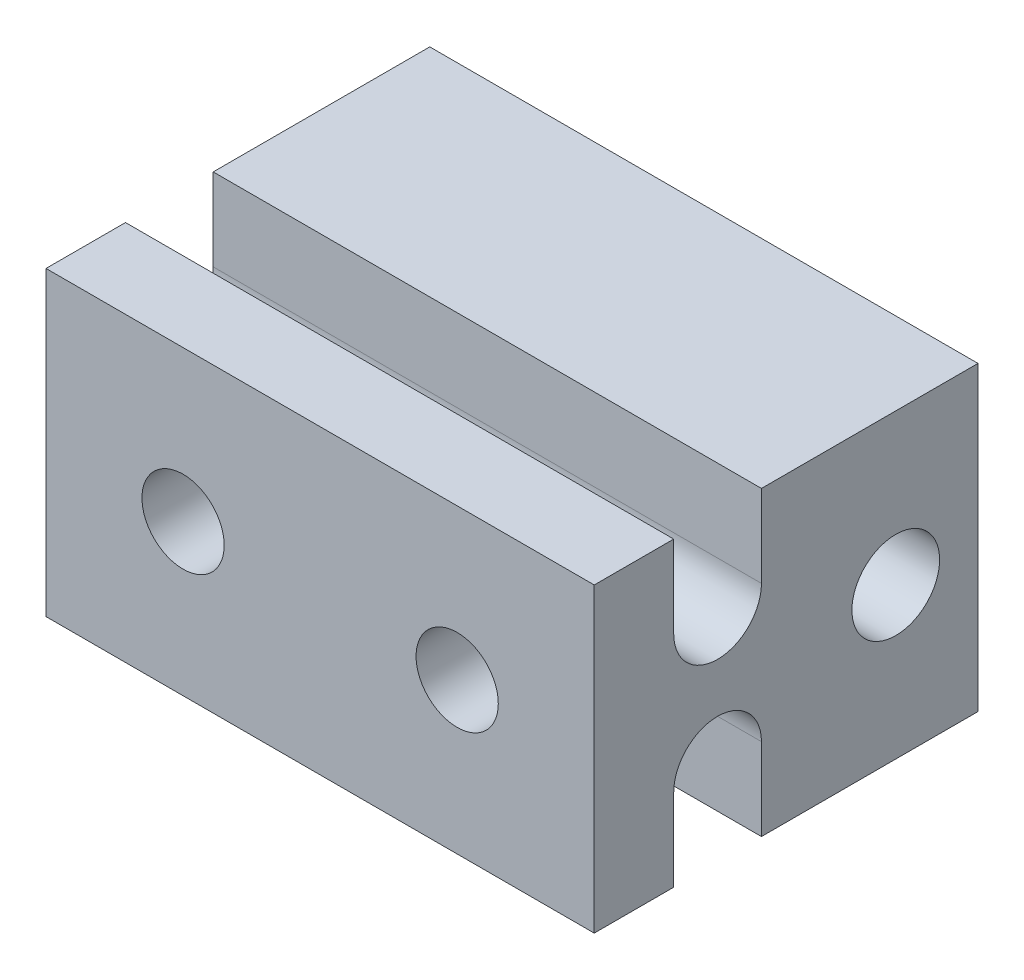
ISO-10303-21;
HEADER;
FILE_DESCRIPTION(('STEP AP214'),'2;1');
FILE_NAME('part.step','',(''),(''),'','','');
FILE_SCHEMA(('AUTOMOTIVE_DESIGN { 1 0 10303 214 1 1 1 1 }'));
ENDSEC;
DATA;
#1=APPLICATION_CONTEXT('core data for automotive mechanical design processes');
#2=APPLICATION_PROTOCOL_DEFINITION('international standard','automotive_design',2000,#1);
#3=PRODUCT_CONTEXT('',#1,'mechanical');
#4=PRODUCT('Part','Part','',(#3));
#5=PRODUCT_RELATED_PRODUCT_CATEGORY('part','',(#4));
#6=PRODUCT_DEFINITION_FORMATION('','',#4);
#7=PRODUCT_DEFINITION_CONTEXT('part definition',#1,'design');
#8=PRODUCT_DEFINITION('design','',#6,#7);
#9=PRODUCT_DEFINITION_SHAPE('','',#8);
#10=(LENGTH_UNIT() NAMED_UNIT(*) SI_UNIT(.MILLI.,.METRE.));
#11=(NAMED_UNIT(*) PLANE_ANGLE_UNIT() SI_UNIT($,.RADIAN.));
#12=(NAMED_UNIT(*) SI_UNIT($,.STERADIAN.) SOLID_ANGLE_UNIT());
#13=UNCERTAINTY_MEASURE_WITH_UNIT(LENGTH_MEASURE(1.E-05),#10,'distance_accuracy_value','');
#14=(GEOMETRIC_REPRESENTATION_CONTEXT(3) GLOBAL_UNCERTAINTY_ASSIGNED_CONTEXT((#13)) GLOBAL_UNIT_ASSIGNED_CONTEXT((#10,
#11,#12)) REPRESENTATION_CONTEXT('',''));
#15=CARTESIAN_POINT('',(0.,0.,0.));
#16=DIRECTION('',(0.,0.,1.));
#17=DIRECTION('',(1.,0.,0.));
#18=AXIS2_PLACEMENT_3D('',#15,#16,#17);
#19=CARTESIAN_POINT('',(10.,5.5,-14.));
#20=DIRECTION('',(1.,0.,0.));
#21=DIRECTION('',(0.,1.,0.));
#22=AXIS2_PLACEMENT_3D('',#19,#20,#21);
#23=PLANE('',#22);
#24=CARTESIAN_POINT('',(10.,0.,-11.));
#25=DIRECTION('',(1.,0.,0.));
#26=DIRECTION('',(0.,1.,0.));
#27=AXIS2_PLACEMENT_3D('',#24,#25,#26);
#28=CIRCLE('',#27,1.6);
#29=CARTESIAN_POINT('',(10.,1.6,-11.));
#30=VERTEX_POINT('',#29);
#31=EDGE_CURVE('E174',#30,#30,#28,.T.);
#32=ORIENTED_EDGE('',*,*,#31,.F.);
#33=EDGE_LOOP('',(#32));
#34=FACE_BOUND('',#33,.T.);
#35=CARTESIAN_POINT('',(10.,2.5,-4.5));
#36=DIRECTION('',(1.,0.,0.));
#37=DIRECTION('',(0.,1.,0.));
#38=AXIS2_PLACEMENT_3D('',#35,#36,#37);
#39=CIRCLE('',#38,1.6);
#40=CARTESIAN_POINT('',(10.,2.5,-2.9));
#41=VERTEX_POINT('',#40);
#42=CARTESIAN_POINT('',(10.,2.5,-6.1));
#43=VERTEX_POINT('',#42);
#44=EDGE_CURVE('E156',#41,#43,#39,.T.);
#45=ORIENTED_EDGE('',*,*,#44,.F.);
#46=DIRECTION('',(0.,1.,0.));
#47=VECTOR('',#46,1.);
#48=CARTESIAN_POINT('',(10.,0.,-2.9));
#49=LINE('',#48,#47);
#50=CARTESIAN_POINT('',(10.,5.5,-2.9));
#51=VERTEX_POINT('',#50);
#52=EDGE_CURVE('E137',#41,#51,#49,.T.);
#53=ORIENTED_EDGE('',*,*,#52,.T.);
#54=DIRECTION('',(0.,0.,1.));
#55=VECTOR('',#54,1.);
#56=CARTESIAN_POINT('',(10.,5.5,-14.));
#57=LINE('',#56,#55);
#58=CARTESIAN_POINT('',(10.,5.5,0.));
#59=VERTEX_POINT('',#58);
#60=EDGE_CURVE('E214',#51,#59,#57,.T.);
#61=ORIENTED_EDGE('',*,*,#60,.T.);
#62=DIRECTION('',(0.,1.,0.));
#63=VECTOR('',#62,1.);
#64=CARTESIAN_POINT('',(10.,5.5,0.));
#65=LINE('',#64,#63);
#66=CARTESIAN_POINT('',(10.,-5.5,0.));
#67=VERTEX_POINT('',#66);
#68=EDGE_CURVE('E194',#67,#59,#65,.T.);
#69=ORIENTED_EDGE('',*,*,#68,.F.);
#70=DIRECTION('',(0.,0.,1.));
#71=VECTOR('',#70,1.);
#72=CARTESIAN_POINT('',(10.,-5.5,-14.));
#73=LINE('',#72,#71);
#74=CARTESIAN_POINT('',(10.,-5.5,-2.9));
#75=VERTEX_POINT('',#74);
#76=EDGE_CURVE('E49',#75,#67,#73,.T.);
#77=ORIENTED_EDGE('',*,*,#76,.F.);
#78=DIRECTION('',(0.,-1.,0.));
#79=VECTOR('',#78,1.);
#80=CARTESIAN_POINT('',(10.,0.,-2.9));
#81=LINE('',#80,#79);
#82=CARTESIAN_POINT('',(10.,-2.5,-2.9));
#83=VERTEX_POINT('',#82);
#84=EDGE_CURVE('E181',#83,#75,#81,.T.);
#85=ORIENTED_EDGE('',*,*,#84,.F.);
#86=CARTESIAN_POINT('',(10.,-2.5,-4.5));
#87=DIRECTION('',(1.,0.,0.));
#88=DIRECTION('',(0.,1.,0.));
#89=AXIS2_PLACEMENT_3D('',#86,#87,#88);
#90=CIRCLE('',#89,1.6);
#91=CARTESIAN_POINT('',(10.,-2.5,-6.1));
#92=VERTEX_POINT('',#91);
#93=EDGE_CURVE('E188',#92,#83,#90,.T.);
#94=ORIENTED_EDGE('',*,*,#93,.F.);
#95=DIRECTION('',(0.,-1.,0.));
#96=VECTOR('',#95,1.);
#97=CARTESIAN_POINT('',(10.,0.,-6.1));
#98=LINE('',#97,#96);
#99=CARTESIAN_POINT('',(10.,-5.5,-6.1));
#100=VERTEX_POINT('',#99);
#101=EDGE_CURVE('E168',#92,#100,#98,.T.);
#102=ORIENTED_EDGE('',*,*,#101,.T.);
#103=CARTESIAN_POINT('',(10.,-5.5,-14.));
#104=VERTEX_POINT('',#103);
#105=EDGE_CURVE('E11',#104,#100,#73,.T.);
#106=ORIENTED_EDGE('',*,*,#105,.F.);
#107=DIRECTION('',(0.,1.,0.));
#108=VECTOR('',#107,1.);
#109=CARTESIAN_POINT('',(10.,5.5,-14.));
#110=LINE('',#109,#108);
#111=CARTESIAN_POINT('',(10.,5.5,-14.));
#112=VERTEX_POINT('',#111);
#113=EDGE_CURVE('E201',#104,#112,#110,.T.);
#114=ORIENTED_EDGE('',*,*,#113,.T.);
#115=CARTESIAN_POINT('',(10.,5.5,-6.1));
#116=VERTEX_POINT('',#115);
#117=EDGE_CURVE('E44',#112,#116,#57,.T.);
#118=ORIENTED_EDGE('',*,*,#117,.T.);
#119=DIRECTION('',(0.,1.,0.));
#120=VECTOR('',#119,1.);
#121=CARTESIAN_POINT('',(10.,0.,-6.1));
#122=LINE('',#121,#120);
#123=EDGE_CURVE('E65',#43,#116,#122,.T.);
#124=ORIENTED_EDGE('',*,*,#123,.F.);
#125=EDGE_LOOP('',(#45,#53,#61,#69,#77,#85,#94,#102,#106,#114,#118,#124));
#126=FACE_BOUND('',#125,.T.);
#127=ADVANCED_FACE('F41',(#34,#126),#23,.T.);
#128=CARTESIAN_POINT('',(-10.,-5.5,-14.));
#129=DIRECTION('',(0.,-1.,0.));
#130=DIRECTION('',(0.,0.,-1.));
#131=AXIS2_PLACEMENT_3D('',#128,#129,#130);
#132=PLANE('',#131);
#133=ORIENTED_EDGE('',*,*,#105,.T.);
#134=DIRECTION('',(1.,0.,0.));
#135=VECTOR('',#134,1.);
#136=CARTESIAN_POINT('',(-10.,-5.50000000000001,-6.1));
#137=LINE('',#136,#135);
#138=CARTESIAN_POINT('',(-10.,-5.50000000000001,-6.1));
#139=VERTEX_POINT('',#138);
#140=EDGE_CURVE('E192',#139,#100,#137,.T.);
#141=ORIENTED_EDGE('',*,*,#140,.F.);
#142=DIRECTION('',(0.,0.,1.));
#143=VECTOR('',#142,1.);
#144=CARTESIAN_POINT('',(-10.,-5.5,-14.));
#145=LINE('',#144,#143);
#146=CARTESIAN_POINT('',(-10.,-5.5,-14.));
#147=VERTEX_POINT('',#146);
#148=EDGE_CURVE('E225',#147,#139,#145,.T.);
#149=ORIENTED_EDGE('',*,*,#148,.F.);
#150=DIRECTION('',(1.,0.,0.));
#151=VECTOR('',#150,1.);
#152=CARTESIAN_POINT('',(-10.,-5.5,-14.));
#153=LINE('',#152,#151);
#154=EDGE_CURVE('E211',#147,#104,#153,.T.);
#155=ORIENTED_EDGE('',*,*,#154,.T.);
#156=EDGE_LOOP('',(#133,#141,#149,#155));
#157=FACE_BOUND('',#156,.T.);
#158=ADVANCED_FACE('F258',(#157),#132,.T.);
#159=CARTESIAN_POINT('',(-10.,5.5,-14.));
#160=DIRECTION('',(-1.,0.,0.));
#161=DIRECTION('',(0.,-1.,0.));
#162=AXIS2_PLACEMENT_3D('',#159,#160,#161);
#163=PLANE('',#162);
#164=CARTESIAN_POINT('',(-10.,0.,-11.));
#165=DIRECTION('',(1.,0.,0.));
#166=DIRECTION('',(0.,1.,0.));
#167=AXIS2_PLACEMENT_3D('',#164,#165,#166);
#168=CIRCLE('',#167,1.6);
#169=CARTESIAN_POINT('',(-10.,1.6,-11.));
#170=VERTEX_POINT('',#169);
#171=EDGE_CURVE('E164',#170,#170,#168,.T.);
#172=ORIENTED_EDGE('',*,*,#171,.T.);
#173=EDGE_LOOP('',(#172));
#174=FACE_BOUND('',#173,.T.);
#175=DIRECTION('',(0.,0.,1.));
#176=VECTOR('',#175,1.);
#177=CARTESIAN_POINT('',(-10.,5.5,-14.));
#178=LINE('',#177,#176);
#179=CARTESIAN_POINT('',(-10.,5.49999999999999,-2.9));
#180=VERTEX_POINT('',#179);
#181=CARTESIAN_POINT('',(-10.,5.5,0.));
#182=VERTEX_POINT('',#181);
#183=EDGE_CURVE('E154',#180,#182,#178,.T.);
#184=ORIENTED_EDGE('',*,*,#183,.F.);
#185=DIRECTION('',(0.,1.,0.));
#186=VECTOR('',#185,1.);
#187=CARTESIAN_POINT('',(-10.,0.,-2.9));
#188=LINE('',#187,#186);
#189=CARTESIAN_POINT('',(-10.,2.5,-2.9));
#190=VERTEX_POINT('',#189);
#191=EDGE_CURVE('E134',#190,#180,#188,.T.);
#192=ORIENTED_EDGE('',*,*,#191,.F.);
#193=CARTESIAN_POINT('',(-10.,2.5,-4.5));
#194=DIRECTION('',(1.,0.,0.));
#195=DIRECTION('',(0.,1.,0.));
#196=AXIS2_PLACEMENT_3D('',#193,#194,#195);
#197=CIRCLE('',#196,1.6);
#198=CARTESIAN_POINT('',(-10.,2.5,-6.1));
#199=VERTEX_POINT('',#198);
#200=EDGE_CURVE('E145',#190,#199,#197,.T.);
#201=ORIENTED_EDGE('',*,*,#200,.T.);
#202=DIRECTION('',(0.,1.,0.));
#203=VECTOR('',#202,1.);
#204=CARTESIAN_POINT('',(-10.,0.,-6.1));
#205=LINE('',#204,#203);
#206=CARTESIAN_POINT('',(-10.,5.49999999999999,-6.1));
#207=VERTEX_POINT('',#206);
#208=EDGE_CURVE('E142',#199,#207,#205,.T.);
#209=ORIENTED_EDGE('',*,*,#208,.T.);
#210=CARTESIAN_POINT('',(-10.,5.5,-14.));
#211=VERTEX_POINT('',#210);
#212=EDGE_CURVE('E228',#211,#207,#178,.T.);
#213=ORIENTED_EDGE('',*,*,#212,.F.);
#214=DIRECTION('',(0.,-1.,0.));
#215=VECTOR('',#214,1.);
#216=CARTESIAN_POINT('',(-10.,5.5,-14.));
#217=LINE('',#216,#215);
#218=EDGE_CURVE('E208',#211,#147,#217,.T.);
#219=ORIENTED_EDGE('',*,*,#218,.T.);
#220=ORIENTED_EDGE('',*,*,#148,.T.);
#221=DIRECTION('',(0.,-1.,0.));
#222=VECTOR('',#221,1.);
#223=CARTESIAN_POINT('',(-10.,0.,-6.1));
#224=LINE('',#223,#222);
#225=CARTESIAN_POINT('',(-10.,-2.5,-6.1));
#226=VERTEX_POINT('',#225);
#227=EDGE_CURVE('E178',#226,#139,#224,.T.);
#228=ORIENTED_EDGE('',*,*,#227,.F.);
#229=CARTESIAN_POINT('',(-10.,-2.5,-4.5));
#230=DIRECTION('',(1.,0.,0.));
#231=DIRECTION('',(0.,1.,0.));
#232=AXIS2_PLACEMENT_3D('',#229,#230,#231);
#233=CIRCLE('',#232,1.6);
#234=CARTESIAN_POINT('',(-10.,-2.5,-2.9));
#235=VERTEX_POINT('',#234);
#236=EDGE_CURVE('E180',#226,#235,#233,.T.);
#237=ORIENTED_EDGE('',*,*,#236,.T.);
#238=DIRECTION('',(0.,-1.,0.));
#239=VECTOR('',#238,1.);
#240=CARTESIAN_POINT('',(-10.,0.,-2.9));
#241=LINE('',#240,#239);
#242=CARTESIAN_POINT('',(-10.,-5.50000000000001,-2.9));
#243=VERTEX_POINT('',#242);
#244=EDGE_CURVE('E57',#235,#243,#241,.T.);
#245=ORIENTED_EDGE('',*,*,#244,.T.);
#246=CARTESIAN_POINT('',(-10.,-5.5,0.));
#247=VERTEX_POINT('',#246);
#248=EDGE_CURVE('E227',#243,#247,#145,.T.);
#249=ORIENTED_EDGE('',*,*,#248,.T.);
#250=DIRECTION('',(0.,-1.,0.));
#251=VECTOR('',#250,1.);
#252=CARTESIAN_POINT('',(-10.,5.5,0.));
#253=LINE('',#252,#251);
#254=EDGE_CURVE('E220',#182,#247,#253,.T.);
#255=ORIENTED_EDGE('',*,*,#254,.F.);
#256=EDGE_LOOP('',(#184,#192,#201,#209,#213,#219,#220,#228,#237,#245,#249,#255));
#257=FACE_BOUND('',#256,.T.);
#258=ADVANCED_FACE('F152',(#174,#257),#163,.T.);
#259=CARTESIAN_POINT('',(-10.,5.5,-14.));
#260=DIRECTION('',(0.,1.,0.));
#261=DIRECTION('',(-1.,0.,0.));
#262=AXIS2_PLACEMENT_3D('',#259,#260,#261);
#263=PLANE('',#262);
#264=ORIENTED_EDGE('',*,*,#60,.F.);
#265=DIRECTION('',(1.,0.,0.));
#266=VECTOR('',#265,1.);
#267=CARTESIAN_POINT('',(-10.,5.49999999999999,-2.9));
#268=LINE('',#267,#266);
#269=EDGE_CURVE('E166',#180,#51,#268,.T.);
#270=ORIENTED_EDGE('',*,*,#269,.F.);
#271=ORIENTED_EDGE('',*,*,#183,.T.);
#272=DIRECTION('',(-1.,0.,0.));
#273=VECTOR('',#272,1.);
#274=CARTESIAN_POINT('',(-10.,5.5,0.));
#275=LINE('',#274,#273);
#276=EDGE_CURVE('E217',#59,#182,#275,.T.);
#277=ORIENTED_EDGE('',*,*,#276,.F.);
#278=EDGE_LOOP('',(#264,#270,#271,#277));
#279=FACE_BOUND('',#278,.T.);
#280=ADVANCED_FACE('F238',(#279),#263,.T.);
#281=DIRECTION('',(1.,0.,0.));
#282=VECTOR('',#281,1.);
#283=CARTESIAN_POINT('',(-10.,-5.50000000000001,-2.9));
#284=LINE('',#283,#282);
#285=EDGE_CURVE('E195',#243,#75,#284,.T.);
#286=ORIENTED_EDGE('',*,*,#285,.T.);
#287=ORIENTED_EDGE('',*,*,#76,.T.);
#288=DIRECTION('',(1.,0.,0.));
#289=VECTOR('',#288,1.);
#290=CARTESIAN_POINT('',(-10.,-5.5,0.));
#291=LINE('',#290,#289);
#292=EDGE_CURVE('E205',#247,#67,#291,.T.);
#293=ORIENTED_EDGE('',*,*,#292,.F.);
#294=ORIENTED_EDGE('',*,*,#248,.F.);
#295=EDGE_LOOP('',(#286,#287,#293,#294));
#296=FACE_BOUND('',#295,.T.);
#297=ADVANCED_FACE('F244',(#296),#132,.T.);
#298=DIRECTION('',(1.,0.,0.));
#299=VECTOR('',#298,1.);
#300=CARTESIAN_POINT('',(-10.,5.49999999999999,-6.1));
#301=LINE('',#300,#299);
#302=EDGE_CURVE('E169',#207,#116,#301,.T.);
#303=ORIENTED_EDGE('',*,*,#302,.T.);
#304=ORIENTED_EDGE('',*,*,#117,.F.);
#305=DIRECTION('',(-1.,0.,0.));
#306=VECTOR('',#305,1.);
#307=CARTESIAN_POINT('',(-10.,5.5,-14.));
#308=LINE('',#307,#306);
#309=EDGE_CURVE('E204',#112,#211,#308,.T.);
#310=ORIENTED_EDGE('',*,*,#309,.T.);
#311=ORIENTED_EDGE('',*,*,#212,.T.);
#312=EDGE_LOOP('',(#303,#304,#310,#311));
#313=FACE_BOUND('',#312,.T.);
#314=ADVANCED_FACE('F264',(#313),#263,.T.);
#315=CARTESIAN_POINT('',(0.,0.,-14.));
#316=DIRECTION('',(0.,0.,1.));
#317=DIRECTION('',(1.,0.,0.));
#318=AXIS2_PLACEMENT_3D('',#315,#316,#317);
#319=PLANE('',#318);
#320=ORIENTED_EDGE('',*,*,#113,.F.);
#321=ORIENTED_EDGE('',*,*,#154,.F.);
#322=ORIENTED_EDGE('',*,*,#218,.F.);
#323=ORIENTED_EDGE('',*,*,#309,.F.);
#324=EDGE_LOOP('',(#320,#321,#322,#323));
#325=FACE_BOUND('',#324,.T.);
#326=ADVANCED_FACE('F262',(#325),#319,.F.);
#327=CARTESIAN_POINT('',(0.,0.,0.));
#328=DIRECTION('',(0.,0.,1.));
#329=DIRECTION('',(1.,0.,0.));
#330=AXIS2_PLACEMENT_3D('',#327,#328,#329);
#331=PLANE('',#330);
#332=CARTESIAN_POINT('',(-5.,0.,0.));
#333=DIRECTION('',(0.,0.,1.));
#334=DIRECTION('',(1.,0.,0.));
#335=AXIS2_PLACEMENT_3D('',#332,#333,#334);
#336=CIRCLE('',#335,1.5);
#337=CARTESIAN_POINT('',(-3.5,0.,0.));
#338=VERTEX_POINT('',#337);
#339=EDGE_CURVE('E474',#338,#338,#336,.T.);
#340=ORIENTED_EDGE('',*,*,#339,.F.);
#341=EDGE_LOOP('',(#340));
#342=FACE_BOUND('',#341,.T.);
#343=CARTESIAN_POINT('',(5.,0.,0.));
#344=DIRECTION('',(0.,0.,1.));
#345=DIRECTION('',(1.,0.,0.));
#346=AXIS2_PLACEMENT_3D('',#343,#344,#345);
#347=CIRCLE('',#346,1.5);
#348=CARTESIAN_POINT('',(6.5,0.,0.));
#349=VERTEX_POINT('',#348);
#350=EDGE_CURVE('E159',#349,#349,#347,.T.);
#351=ORIENTED_EDGE('',*,*,#350,.F.);
#352=EDGE_LOOP('',(#351));
#353=FACE_BOUND('',#352,.T.);
#354=ORIENTED_EDGE('',*,*,#68,.T.);
#355=ORIENTED_EDGE('',*,*,#276,.T.);
#356=ORIENTED_EDGE('',*,*,#254,.T.);
#357=ORIENTED_EDGE('',*,*,#292,.T.);
#358=EDGE_LOOP('',(#354,#355,#356,#357));
#359=FACE_BOUND('',#358,.T.);
#360=ADVANCED_FACE('F240',(#342,#353,#359),#331,.T.);
#361=CARTESIAN_POINT('',(-10.,0.,-2.9));
#362=DIRECTION('',(0.,0.,-1.));
#363=DIRECTION('',(0.,1.,0.));
#364=AXIS2_PLACEMENT_3D('',#361,#362,#363);
#365=PLANE('',#364);
#366=ORIENTED_EDGE('',*,*,#52,.F.);
#367=DIRECTION('',(1.,0.,0.));
#368=VECTOR('',#367,1.);
#369=CARTESIAN_POINT('',(-10.,2.5,-2.9));
#370=LINE('',#369,#368);
#371=EDGE_CURVE('E130',#190,#41,#370,.T.);
#372=ORIENTED_EDGE('',*,*,#371,.F.);
#373=ORIENTED_EDGE('',*,*,#191,.T.);
#374=ORIENTED_EDGE('',*,*,#269,.T.);
#375=EDGE_LOOP('',(#366,#372,#373,#374));
#376=FACE_BOUND('',#375,.T.);
#377=ADVANCED_FACE('F132',(#376),#365,.T.);
#378=CARTESIAN_POINT('',(-10.,0.,-6.1));
#379=DIRECTION('',(0.,0.,-1.));
#380=DIRECTION('',(-1.,0.,0.));
#381=AXIS2_PLACEMENT_3D('',#378,#379,#380);
#382=PLANE('',#381);
#383=ORIENTED_EDGE('',*,*,#123,.T.);
#384=ORIENTED_EDGE('',*,*,#302,.F.);
#385=ORIENTED_EDGE('',*,*,#208,.F.);
#386=DIRECTION('',(1.,0.,0.));
#387=VECTOR('',#386,1.);
#388=CARTESIAN_POINT('',(-10.,2.5,-6.1));
#389=LINE('',#388,#387);
#390=EDGE_CURVE('E141',#199,#43,#389,.T.);
#391=ORIENTED_EDGE('',*,*,#390,.T.);
#392=EDGE_LOOP('',(#383,#384,#385,#391));
#393=FACE_BOUND('',#392,.T.);
#394=ADVANCED_FACE('F265',(#393),#382,.F.);
#395=CARTESIAN_POINT('',(-10.,2.5,-4.5));
#396=DIRECTION('',(1.,0.,0.));
#397=DIRECTION('',(0.,1.,0.));
#398=AXIS2_PLACEMENT_3D('',#395,#396,#397);
#399=CYLINDRICAL_SURFACE('',#398,1.6);
#400=ORIENTED_EDGE('',*,*,#44,.T.);
#401=ORIENTED_EDGE('',*,*,#390,.F.);
#402=ORIENTED_EDGE('',*,*,#200,.F.);
#403=ORIENTED_EDGE('',*,*,#371,.T.);
#404=EDGE_LOOP('',(#400,#401,#402,#403));
#405=FACE_BOUND('',#404,.T.);
#406=ADVANCED_FACE('F146',(#405),#399,.F.);
#407=CARTESIAN_POINT('',(-10.,0.,-6.1));
#408=DIRECTION('',(0.,0.,1.));
#409=DIRECTION('',(0.,-1.,0.));
#410=AXIS2_PLACEMENT_3D('',#407,#408,#409);
#411=PLANE('',#410);
#412=ORIENTED_EDGE('',*,*,#101,.F.);
#413=DIRECTION('',(1.,0.,0.));
#414=VECTOR('',#413,1.);
#415=CARTESIAN_POINT('',(-10.,-2.5,-6.1));
#416=LINE('',#415,#414);
#417=EDGE_CURVE('E185',#226,#92,#416,.T.);
#418=ORIENTED_EDGE('',*,*,#417,.F.);
#419=ORIENTED_EDGE('',*,*,#227,.T.);
#420=ORIENTED_EDGE('',*,*,#140,.T.);
#421=EDGE_LOOP('',(#412,#418,#419,#420));
#422=FACE_BOUND('',#421,.T.);
#423=ADVANCED_FACE('F254',(#422),#411,.T.);
#424=CARTESIAN_POINT('',(-10.,0.,-2.9));
#425=DIRECTION('',(0.,0.,1.));
#426=DIRECTION('',(0.,-1.,0.));
#427=AXIS2_PLACEMENT_3D('',#424,#425,#426);
#428=PLANE('',#427);
#429=ORIENTED_EDGE('',*,*,#84,.T.);
#430=ORIENTED_EDGE('',*,*,#285,.F.);
#431=ORIENTED_EDGE('',*,*,#244,.F.);
#432=DIRECTION('',(1.,0.,0.));
#433=VECTOR('',#432,1.);
#434=CARTESIAN_POINT('',(-10.,-2.5,-2.9));
#435=LINE('',#434,#433);
#436=EDGE_CURVE('E198',#235,#83,#435,.T.);
#437=ORIENTED_EDGE('',*,*,#436,.T.);
#438=EDGE_LOOP('',(#429,#430,#431,#437));
#439=FACE_BOUND('',#438,.T.);
#440=ADVANCED_FACE('F247',(#439),#428,.F.);
#441=CARTESIAN_POINT('',(-10.,-2.5,-4.5));
#442=DIRECTION('',(1.,0.,0.));
#443=DIRECTION('',(0.,1.,0.));
#444=AXIS2_PLACEMENT_3D('',#441,#442,#443);
#445=CYLINDRICAL_SURFACE('',#444,1.6);
#446=ORIENTED_EDGE('',*,*,#93,.T.);
#447=ORIENTED_EDGE('',*,*,#436,.F.);
#448=ORIENTED_EDGE('',*,*,#236,.F.);
#449=ORIENTED_EDGE('',*,*,#417,.T.);
#450=EDGE_LOOP('',(#446,#447,#448,#449));
#451=FACE_BOUND('',#450,.T.);
#452=ADVANCED_FACE('F250',(#451),#445,.F.);
#453=CARTESIAN_POINT('',(-10.,0.,-11.));
#454=DIRECTION('',(1.,0.,0.));
#455=DIRECTION('',(0.,1.,0.));
#456=AXIS2_PLACEMENT_3D('',#453,#454,#455);
#457=CYLINDRICAL_SURFACE('',#456,1.6);
#458=ORIENTED_EDGE('',*,*,#171,.F.);
#459=EDGE_LOOP('',(#458));
#460=FACE_BOUND('',#459,.T.);
#461=ORIENTED_EDGE('',*,*,#31,.T.);
#462=EDGE_LOOP('',(#461));
#463=FACE_BOUND('',#462,.T.);
#464=ADVANCED_FACE('F283',(#460,#463),#457,.F.);
#465=CARTESIAN_POINT('',(5.,0.,-7.14264068711929));
#466=DIRECTION('',(0.,0.,1.));
#467=DIRECTION('',(1.,0.,0.));
#468=AXIS2_PLACEMENT_3D('',#465,#466,#467);
#469=CYLINDRICAL_SURFACE('',#468,1.5);
#470=CARTESIAN_POINT('',(5.,0.,-2.9));
#471=DIRECTION('',(0.,0.,1.));
#472=DIRECTION('',(0.,-1.,0.));
#473=AXIS2_PLACEMENT_3D('',#470,#471,#472);
#474=CIRCLE('',#473,1.5);
#475=CARTESIAN_POINT('',(5.,-1.5,-2.9));
#476=VERTEX_POINT('',#475);
#477=EDGE_CURVE('E478',#476,#476,#474,.F.);
#478=ORIENTED_EDGE('',*,*,#477,.T.);
#479=EDGE_LOOP('',(#478));
#480=FACE_BOUND('',#479,.T.);
#481=ORIENTED_EDGE('',*,*,#350,.T.);
#482=EDGE_LOOP('',(#481));
#483=FACE_BOUND('',#482,.T.);
#484=ADVANCED_FACE('F285',(#480,#483),#469,.F.);
#485=CARTESIAN_POINT('',(-10.,0.,-2.9));
#486=DIRECTION('',(0.,0.,1.));
#487=DIRECTION('',(0.,-1.,0.));
#488=AXIS2_PLACEMENT_3D('',#485,#486,#487);
#489=PLANE('',#488);
#490=ORIENTED_EDGE('',*,*,#477,.F.);
#491=EDGE_LOOP('',(#490));
#492=FACE_BOUND('',#491,.T.);
#493=ADVANCED_FACE('F292',(#492),#489,.T.);
#494=CARTESIAN_POINT('',(-5.,0.,-7.14264068711929));
#495=DIRECTION('',(0.,0.,1.));
#496=DIRECTION('',(1.,0.,0.));
#497=AXIS2_PLACEMENT_3D('',#494,#495,#496);
#498=CYLINDRICAL_SURFACE('',#497,1.5);
#499=CARTESIAN_POINT('',(-5.,0.,-2.9));
#500=DIRECTION('',(0.,0.,1.));
#501=DIRECTION('',(0.,-1.,0.));
#502=AXIS2_PLACEMENT_3D('',#499,#500,#501);
#503=CIRCLE('',#502,1.5);
#504=CARTESIAN_POINT('',(-5.,-1.5,-2.9));
#505=VERTEX_POINT('',#504);
#506=EDGE_CURVE('E177',#505,#505,#503,.F.);
#507=ORIENTED_EDGE('',*,*,#506,.T.);
#508=EDGE_LOOP('',(#507));
#509=FACE_BOUND('',#508,.T.);
#510=ORIENTED_EDGE('',*,*,#339,.T.);
#511=EDGE_LOOP('',(#510));
#512=FACE_BOUND('',#511,.T.);
#513=ADVANCED_FACE('F401',(#509,#512),#498,.F.);
#514=CARTESIAN_POINT('',(-10.,0.,-2.9));
#515=DIRECTION('',(0.,0.,1.));
#516=DIRECTION('',(0.,-1.,0.));
#517=AXIS2_PLACEMENT_3D('',#514,#515,#516);
#518=PLANE('',#517);
#519=ORIENTED_EDGE('',*,*,#506,.F.);
#520=EDGE_LOOP('',(#519));
#521=FACE_BOUND('',#520,.T.);
#522=ADVANCED_FACE('F411',(#521),#518,.T.);
#523=CLOSED_SHELL('',(#127,#158,#258,#280,#297,#314,#326,#360,#377,#394,#406,#423,#440,#452,
#464,#484,#493,#513,#522));
#524=MANIFOLD_SOLID_BREP('B2',#523);
#525=ADVANCED_BREP_SHAPE_REPRESENTATION('',(#18,#524),#14);
#526=SHAPE_DEFINITION_REPRESENTATION(#9,#525);
ENDSEC;
END-ISO-10303-21;
